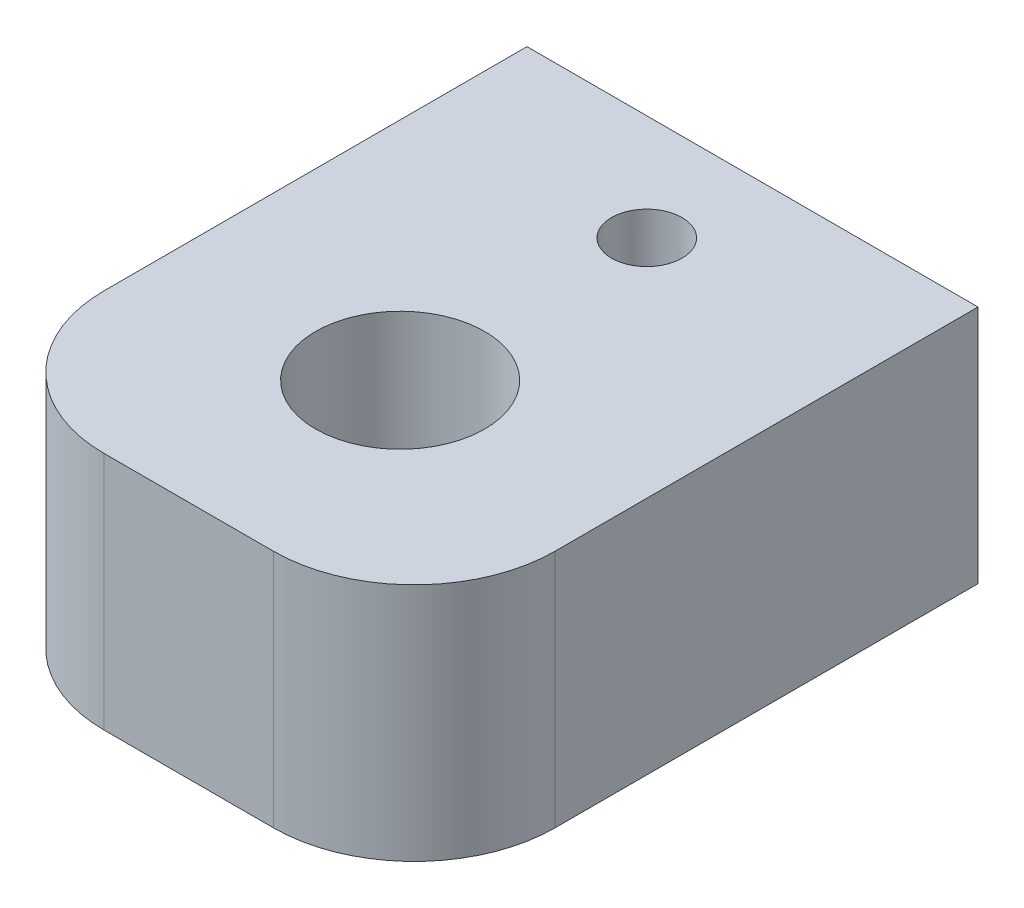
ISO-10303-21;
HEADER;
FILE_DESCRIPTION(('STEP AP214'),'2;1');
FILE_NAME('part.step','',(''),(''),'','','');
FILE_SCHEMA(('AUTOMOTIVE_DESIGN { 1 0 10303 214 1 1 1 1 }'));
ENDSEC;
DATA;
#1=APPLICATION_CONTEXT('core data for automotive mechanical design processes');
#2=APPLICATION_PROTOCOL_DEFINITION('international standard','automotive_design',2000,#1);
#3=PRODUCT_CONTEXT('',#1,'mechanical');
#4=PRODUCT('Part','Part','',(#3));
#5=PRODUCT_RELATED_PRODUCT_CATEGORY('part','',(#4));
#6=PRODUCT_DEFINITION_FORMATION('','',#4);
#7=PRODUCT_DEFINITION_CONTEXT('part definition',#1,'design');
#8=PRODUCT_DEFINITION('design','',#6,#7);
#9=PRODUCT_DEFINITION_SHAPE('','',#8);
#10=(LENGTH_UNIT() NAMED_UNIT(*) SI_UNIT(.MILLI.,.METRE.));
#11=(NAMED_UNIT(*) PLANE_ANGLE_UNIT() SI_UNIT($,.RADIAN.));
#12=(NAMED_UNIT(*) SI_UNIT($,.STERADIAN.) SOLID_ANGLE_UNIT());
#13=UNCERTAINTY_MEASURE_WITH_UNIT(LENGTH_MEASURE(1.E-05),#10,'distance_accuracy_value','');
#14=(GEOMETRIC_REPRESENTATION_CONTEXT(3) GLOBAL_UNCERTAINTY_ASSIGNED_CONTEXT((#13)) GLOBAL_UNIT_ASSIGNED_CONTEXT((#10,
#11,#12)) REPRESENTATION_CONTEXT('',''));
#15=CARTESIAN_POINT('',(0.,0.,0.));
#16=DIRECTION('',(0.,0.,1.));
#17=DIRECTION('',(1.,0.,0.));
#18=AXIS2_PLACEMENT_3D('',#15,#16,#17);
#19=CARTESIAN_POINT('',(0.,17.,-12.5));
#20=DIRECTION('',(0.,-1.,0.));
#21=DIRECTION('',(0.,0.,-1.));
#22=AXIS2_PLACEMENT_3D('',#19,#20,#21);
#23=CYLINDRICAL_SURFACE('',#22,2.5);
#24=CARTESIAN_POINT('',(0.,13.5,-15.));
#25=CARTESIAN_POINT('',(-0.131426682334305,13.4999917755047,-14.999990330944));
#26=CARTESIAN_POINT('',(-0.263015634437213,13.4947619913528,-14.989574438226));
#27=CARTESIAN_POINT('',(-0.522301454622883,13.4743541856102,-14.9483681788379));
#28=CARTESIAN_POINT('',(-0.649990448564105,13.4591572718767,-14.917539119075));
#29=CARTESIAN_POINT('',(-0.897333631316204,13.4204069092248,-14.8370153772812));
#30=CARTESIAN_POINT('',(-1.01701694536277,13.3968859590726,-14.7873940122173));
#31=CARTESIAN_POINT('',(-1.24618160399671,13.3436444332583,-14.6710734737482));
#32=CARTESIAN_POINT('',(-1.3556637520377,13.3139243464442,-14.6043756468549));
#33=CARTESIAN_POINT('',(-1.56876952630998,13.2489064505063,-14.4512068683574));
#34=CARTESIAN_POINT('',(-1.67163802294309,13.2133799765909,-14.3637837997702));
#35=CARTESIAN_POINT('',(-1.86194861703333,13.1414992577673,-14.1736963040147));
#36=CARTESIAN_POINT('',(-1.94937895911555,13.105144405669,-14.0710203711599));
#37=CARTESIAN_POINT('',(-2.11312999967247,13.0324737794562,-13.8437916255547));
#38=CARTESIAN_POINT('',(-2.18806333849064,12.9963796741257,-13.718159753965));
#39=CARTESIAN_POINT('',(-2.31542056761491,12.9321494694356,-13.4540816602046));
#40=CARTESIAN_POINT('',(-2.36786053751683,12.9040076902079,-13.3156446782374));
#41=CARTESIAN_POINT('',(-2.44533110537653,12.861446675914,-13.0383372364036));
#42=CARTESIAN_POINT('',(-2.47181464267578,12.8463067895845,-12.8999888698204));
#43=CARTESIAN_POINT('',(-2.50106748329741,12.8295472487215,-12.6200529055624));
#44=CARTESIAN_POINT('',(-2.50386022093906,12.8279142335843,-12.4784686478249));
#45=CARTESIAN_POINT('',(-2.48671821792512,12.8377732564294,-12.2142849392091));
#46=CARTESIAN_POINT('',(-2.46946139884055,12.8477190915498,-12.0914399219417));
#47=CARTESIAN_POINT('',(-2.41734962264384,12.8769057183468,-11.8506952265681));
#48=CARTESIAN_POINT('',(-2.38248905974454,12.8961494707945,-11.7327971367369));
#49=CARTESIAN_POINT('',(-2.29552445096459,12.9421869103184,-11.5019271685857));
#50=CARTESIAN_POINT('',(-2.24303766778988,12.9691460165999,-11.3891340030355));
#51=CARTESIAN_POINT('',(-2.12260421917012,13.0275851070351,-11.173414268525));
#52=CARTESIAN_POINT('',(-2.0546506095312,13.0590671195048,-11.0704921609998));
#53=CARTESIAN_POINT('',(-1.89516513728194,13.1278289475821,-10.8636968681419));
#54=CARTESIAN_POINT('',(-1.8017361459232,13.1653377559186,-10.7613578160596));
#55=CARTESIAN_POINT('',(-1.59888894685344,13.2386905825102,-10.5731614535227));
#56=CARTESIAN_POINT('',(-1.48946314143571,13.27453379897,-10.4873120199153));
#57=CARTESIAN_POINT('',(-1.25129126457962,13.3425496820741,-10.3307858474257));
#58=CARTESIAN_POINT('',(-1.12188397899853,13.3744746040502,-10.2609988188856));
#59=CARTESIAN_POINT('',(-0.851165538721986,13.4289470280311,-10.1447574273925));
#60=CARTESIAN_POINT('',(-0.709863940663163,13.4515019735889,-10.0982845374621));
#61=CARTESIAN_POINT('',(-0.431916229151781,13.4831083435358,-10.0338114907083));
#62=CARTESIAN_POINT('',(-0.295853826370907,13.4931234575324,-10.013771910633));
#63=CARTESIAN_POINT('',(-0.0219489998732891,13.5018253364779,-9.99633817216382));
#64=CARTESIAN_POINT('',(0.115892549675108,13.5005174680343,-9.9989332859015));
#65=CARTESIAN_POINT('',(0.378082429964656,13.4872798063347,-10.0255167210467));
#66=CARTESIAN_POINT('',(0.502648520123706,13.4761811421999,-10.0478313318244));
#67=CARTESIAN_POINT('',(0.746017230755972,13.4455542828753,-10.1105951797384));
#68=CARTESIAN_POINT('',(0.864819214231883,13.4260251583762,-10.1510464161359));
#69=CARTESIAN_POINT('',(1.09722152111965,13.3796062853233,-10.2499961660804));
#70=CARTESIAN_POINT('',(1.21057599249831,13.3525220441787,-10.3089776252823));
#71=CARTESIAN_POINT('',(1.42615340426439,13.2935993579975,-10.4427688391248));
#72=CARTESIAN_POINT('',(1.52837157450204,13.2617588894053,-10.5175853365199));
#73=CARTESIAN_POINT('',(1.72941922315487,13.1927055331509,-10.6894010632909));
#74=CARTESIAN_POINT('',(1.82693019428496,13.1552721200949,-10.7878571709752));
#75=CARTESIAN_POINT('',(2.0046408025722,13.0815597892159,-10.9998128780494));
#76=CARTESIAN_POINT('',(2.08482846428685,13.0452816847241,-11.1133227970699));
#77=CARTESIAN_POINT('',(2.22926978618995,12.9762798054528,-11.3591091354846));
#78=CARTESIAN_POINT('',(2.29256373922243,12.9438132398125,-11.4920281652911));
#79=CARTESIAN_POINT('',(2.39520706511459,12.8893518072675,-11.7687751688825));
#80=CARTESIAN_POINT('',(2.43458729077056,12.8673434554901,-11.912588816));
#81=CARTESIAN_POINT('',(2.48465421767005,12.8390375256935,-12.1922755573629));
#82=CARTESIAN_POINT('',(2.49773248744361,12.831434586741,-12.327585634119));
#83=CARTESIAN_POINT('',(2.50172288950899,12.8291338659258,-12.5986176673807));
#84=CARTESIAN_POINT('',(2.49264462983266,12.8344304902511,-12.7343394198736));
#85=CARTESIAN_POINT('',(2.45481530197332,12.8559465516466,-12.9887087556168));
#86=CARTESIAN_POINT('',(2.42802074302696,12.8710773633813,-13.1077511817208));
#87=CARTESIAN_POINT('',(2.35793843840544,12.909275403376,-13.3395202922));
#88=CARTESIAN_POINT('',(2.31464538728732,12.9323451843496,-13.4522449315665));
#89=CARTESIAN_POINT('',(2.20953919315538,12.9857132643341,-13.6765621527197));
#90=CARTESIAN_POINT('',(2.14667719009404,13.0163930799845,-13.787569851735));
#91=CARTESIAN_POINT('',(2.0053780838799,13.0808832707746,-13.99818624324));
#92=CARTESIAN_POINT('',(1.92693287765889,13.1146952697077,-14.0977889626287));
#93=CARTESIAN_POINT('',(1.74550556946066,13.1865581632701,-14.2953553637496));
#94=CARTESIAN_POINT('',(1.6407002246921,13.2246249151498,-14.3916493641714));
#95=CARTESIAN_POINT('',(1.41539785420684,13.2969434738354,-14.565655849428));
#96=CARTESIAN_POINT('',(1.29489242426332,13.3311932190545,-14.6433583186059));
#97=CARTESIAN_POINT('',(1.03978808878537,13.3924514945778,-14.7780969794841));
#98=CARTESIAN_POINT('',(0.90509556078229,13.4194071143749,-14.8349831677844));
#99=CARTESIAN_POINT('',(0.696328709257353,13.4517796092335,-14.9021838587924));
#100=CARTESIAN_POINT('',(0.625670413494089,13.4612231408187,-14.9215553980018));
#101=CARTESIAN_POINT('',(0.482623997839258,13.477171272751,-14.9540659483706));
#102=CARTESIAN_POINT('',(0.410236963092402,13.4836776682316,-14.9672087666763));
#103=CARTESIAN_POINT('',(0.281518684621671,13.4923820076613,-14.9847374722846));
#104=CARTESIAN_POINT('',(0.225408499555444,13.4952328846645,-14.9904549365313));
#105=CARTESIAN_POINT('',(0.112875528456288,13.4990436732966,-14.9980883294657));
#106=CARTESIAN_POINT('',(0.0564527338382177,13.500003532732,-15.0000041532255));
#107=CARTESIAN_POINT('',(0.,13.5,-15.));
#108=B_SPLINE_CURVE_WITH_KNOTS('',3,(#24,#25,#26,#27,#28,#29,#30,#31,#32,#33,#34,#35,#36,#37,
#38,#39,#40,#41,#42,#43,#44,#45,#46,#47,#48,#49,#50,#51,#52,#53,#54,#55,#56,#57,#58,#59,#60,#61,
#62,#63,#64,#65,#66,#67,#68,#69,#70,#71,#72,#73,#74,#75,#76,#77,#78,#79,#80,#81,#82,#83,#84,#85,
#86,#87,#88,#89,#90,#91,#92,#93,#94,#95,#96,#97,#98,#99,#100,#101,#102,#103,#104,#105,#106,
#107),.UNSPECIFIED.,.T.,.F.,(4,2,2,2,2,2,2,2,2,2,2,2,2,2,2,2,2,2,2,2,2,2,2,2,2,2,2,2,2,2,2,2,2,
2,2,2,2,2,2,2,2,4),(0.,0.394060643550731,0.788870374272995,1.18215538873075,1.57540940145392,
1.99245439679522,2.40981559413509,2.85954316076882,3.30894869745703,3.73145030350574,
4.15353393322551,4.52514281023301,4.89687009814196,5.27725600421219,5.65781303150555,
6.08662353334697,6.51563836496716,6.96457555536102,7.41315542280699,7.82458226178364,
8.2358141127869,8.61517266265305,8.99457304077329,9.38482140069747,9.77523626870849,
10.2039902661037,10.6330397153795,11.0828670540368,11.53211279863,11.9382326875699,
12.3441764966107,12.7114482562151,13.0788382197025,13.4709114195009,13.8631890285845,
14.303131068923,14.7433095845248,15.1866003415819,15.407934939208,15.6291340766844,
15.7983933645035,15.9676573239323),.UNSPECIFIED.);
#109=CARTESIAN_POINT('',(0.,13.5,-15.));
#110=VERTEX_POINT('',#109);
#111=EDGE_CURVE('E47',#110,#110,#108,.T.);
#112=ORIENTED_EDGE('',*,*,#111,.F.);
#113=EDGE_LOOP('',(#112));
#114=FACE_BOUND('',#113,.T.);
#115=CARTESIAN_POINT('',(0.,17.,-12.5));
#116=DIRECTION('',(0.,1.,0.));
#117=DIRECTION('',(0.,0.,1.));
#118=AXIS2_PLACEMENT_3D('',#115,#116,#117);
#119=CIRCLE('',#118,2.5);
#120=CARTESIAN_POINT('',(0.,17.,-9.99999999999999));
#121=VERTEX_POINT('',#120);
#122=EDGE_CURVE('E146',#121,#121,#119,.T.);
#123=ORIENTED_EDGE('',*,*,#122,.T.);
#124=EDGE_LOOP('',(#123));
#125=FACE_BOUND('',#124,.T.);
#126=ADVANCED_FACE('F43',(#114,#125),#23,.F.);
#127=CARTESIAN_POINT('',(-6.00000000000001,17.,10.));
#128=DIRECTION('',(0.,-1.,0.));
#129=DIRECTION('',(0.,0.,-1.));
#130=AXIS2_PLACEMENT_3D('',#127,#128,#129);
#131=PLANE('',#130);
#132=DIRECTION('',(0.,0.,1.));
#133=VECTOR('',#132,1.);
#134=CARTESIAN_POINT('',(-16.,17.,-20.));
#135=LINE('',#134,#133);
#136=CARTESIAN_POINT('',(-16.,17.,-20.));
#137=VERTEX_POINT('',#136);
#138=CARTESIAN_POINT('',(-16.,17.,10.));
#139=VERTEX_POINT('',#138);
#140=EDGE_CURVE('E158',#137,#139,#135,.T.);
#141=ORIENTED_EDGE('',*,*,#140,.T.);
#142=CARTESIAN_POINT('',(-6.00000000000001,17.,10.));
#143=DIRECTION('',(0.,1.,0.));
#144=DIRECTION('',(0.,0.,-1.));
#145=AXIS2_PLACEMENT_3D('',#142,#143,#144);
#146=CIRCLE('',#145,10.);
#147=CARTESIAN_POINT('',(-6.00000000000001,17.,20.));
#148=VERTEX_POINT('',#147);
#149=EDGE_CURVE('E105',#139,#148,#146,.T.);
#150=ORIENTED_EDGE('',*,*,#149,.T.);
#151=DIRECTION('',(1.,0.,0.));
#152=VECTOR('',#151,1.);
#153=CARTESIAN_POINT('',(-6.00000000000001,17.,20.));
#154=LINE('',#153,#152);
#155=CARTESIAN_POINT('',(6.00000000000001,17.,20.));
#156=VERTEX_POINT('',#155);
#157=EDGE_CURVE('E119',#148,#156,#154,.T.);
#158=ORIENTED_EDGE('',*,*,#157,.T.);
#159=CARTESIAN_POINT('',(6.00000000000001,17.,10.));
#160=DIRECTION('',(0.,1.,0.));
#161=DIRECTION('',(0.,0.,-1.));
#162=AXIS2_PLACEMENT_3D('',#159,#160,#161);
#163=CIRCLE('',#162,10.);
#164=CARTESIAN_POINT('',(16.,17.,10.));
#165=VERTEX_POINT('',#164);
#166=EDGE_CURVE('E112',#156,#165,#163,.T.);
#167=ORIENTED_EDGE('',*,*,#166,.T.);
#168=DIRECTION('',(0.,0.,-1.));
#169=VECTOR('',#168,1.);
#170=CARTESIAN_POINT('',(16.,17.,-20.));
#171=LINE('',#170,#169);
#172=CARTESIAN_POINT('',(16.,17.,-20.));
#173=VERTEX_POINT('',#172);
#174=EDGE_CURVE('E117',#165,#173,#171,.T.);
#175=ORIENTED_EDGE('',*,*,#174,.T.);
#176=DIRECTION('',(-1.,0.,0.));
#177=VECTOR('',#176,1.);
#178=CARTESIAN_POINT('',(-16.,17.,-20.));
#179=LINE('',#178,#177);
#180=EDGE_CURVE('E68',#173,#137,#179,.T.);
#181=ORIENTED_EDGE('',*,*,#180,.T.);
#182=EDGE_LOOP('',(#141,#150,#158,#167,#175,#181));
#183=FACE_BOUND('',#182,.T.);
#184=ORIENTED_EDGE('',*,*,#122,.F.);
#185=EDGE_LOOP('',(#184));
#186=FACE_BOUND('',#185,.T.);
#187=CARTESIAN_POINT('',(0.,17.,5.));
#188=DIRECTION('',(0.,1.,0.));
#189=DIRECTION('',(0.,0.,1.));
#190=AXIS2_PLACEMENT_3D('',#187,#188,#189);
#191=CIRCLE('',#190,6.);
#192=CARTESIAN_POINT('',(0.,17.,11.));
#193=VERTEX_POINT('',#192);
#194=EDGE_CURVE('E211',#193,#193,#191,.T.);
#195=ORIENTED_EDGE('',*,*,#194,.F.);
#196=EDGE_LOOP('',(#195));
#197=FACE_BOUND('',#196,.T.);
#198=ADVANCED_FACE('F114',(#183,#186,#197),#131,.F.);
#199=CARTESIAN_POINT('',(-6.00000000000001,0.,10.));
#200=DIRECTION('',(0.,-1.,0.));
#201=DIRECTION('',(0.,0.,-1.));
#202=AXIS2_PLACEMENT_3D('',#199,#200,#201);
#203=PLANE('',#202);
#204=CARTESIAN_POINT('',(0.,0.,-12.5));
#205=DIRECTION('',(0.,1.,0.));
#206=DIRECTION('',(0.,0.,1.));
#207=AXIS2_PLACEMENT_3D('',#204,#205,#206);
#208=CIRCLE('',#207,2.5);
#209=CARTESIAN_POINT('',(0.,0.,-9.99999999999999));
#210=VERTEX_POINT('',#209);
#211=EDGE_CURVE('E207',#210,#210,#208,.T.);
#212=ORIENTED_EDGE('',*,*,#211,.T.);
#213=EDGE_LOOP('',(#212));
#214=FACE_BOUND('',#213,.T.);
#215=DIRECTION('',(0.,0.,1.));
#216=VECTOR('',#215,1.);
#217=CARTESIAN_POINT('',(-16.,0.,-20.));
#218=LINE('',#217,#216);
#219=CARTESIAN_POINT('',(-16.,0.,-20.));
#220=VERTEX_POINT('',#219);
#221=CARTESIAN_POINT('',(-16.,0.,10.));
#222=VERTEX_POINT('',#221);
#223=EDGE_CURVE('E141',#220,#222,#218,.T.);
#224=ORIENTED_EDGE('',*,*,#223,.F.);
#225=DIRECTION('',(-1.,0.,0.));
#226=VECTOR('',#225,1.);
#227=CARTESIAN_POINT('',(-16.,0.,-20.));
#228=LINE('',#227,#226);
#229=CARTESIAN_POINT('',(16.,0.,-20.));
#230=VERTEX_POINT('',#229);
#231=EDGE_CURVE('E97',#230,#220,#228,.T.);
#232=ORIENTED_EDGE('',*,*,#231,.F.);
#233=DIRECTION('',(0.,0.,-1.));
#234=VECTOR('',#233,1.);
#235=CARTESIAN_POINT('',(16.,0.,-20.));
#236=LINE('',#235,#234);
#237=CARTESIAN_POINT('',(16.,0.,10.));
#238=VERTEX_POINT('',#237);
#239=EDGE_CURVE('E91',#238,#230,#236,.T.);
#240=ORIENTED_EDGE('',*,*,#239,.F.);
#241=CARTESIAN_POINT('',(6.00000000000001,0.,10.));
#242=DIRECTION('',(0.,1.,0.));
#243=DIRECTION('',(0.,0.,-1.));
#244=AXIS2_PLACEMENT_3D('',#241,#242,#243);
#245=CIRCLE('',#244,10.);
#246=CARTESIAN_POINT('',(6.00000000000001,0.,20.));
#247=VERTEX_POINT('',#246);
#248=EDGE_CURVE('E128',#247,#238,#245,.T.);
#249=ORIENTED_EDGE('',*,*,#248,.F.);
#250=DIRECTION('',(1.,0.,0.));
#251=VECTOR('',#250,1.);
#252=CARTESIAN_POINT('',(-6.00000000000001,0.,20.));
#253=LINE('',#252,#251);
#254=CARTESIAN_POINT('',(-6.00000000000001,0.,20.));
#255=VERTEX_POINT('',#254);
#256=EDGE_CURVE('E149',#255,#247,#253,.T.);
#257=ORIENTED_EDGE('',*,*,#256,.F.);
#258=CARTESIAN_POINT('',(-6.00000000000001,0.,10.));
#259=DIRECTION('',(0.,1.,0.));
#260=DIRECTION('',(0.,0.,-1.));
#261=AXIS2_PLACEMENT_3D('',#258,#259,#260);
#262=CIRCLE('',#261,10.);
#263=EDGE_CURVE('E145',#222,#255,#262,.T.);
#264=ORIENTED_EDGE('',*,*,#263,.F.);
#265=EDGE_LOOP('',(#224,#232,#240,#249,#257,#264));
#266=FACE_BOUND('',#265,.T.);
#267=CARTESIAN_POINT('',(0.,0.,5.));
#268=DIRECTION('',(0.,1.,0.));
#269=DIRECTION('',(0.,0.,1.));
#270=AXIS2_PLACEMENT_3D('',#267,#268,#269);
#271=CIRCLE('',#270,6.);
#272=CARTESIAN_POINT('',(0.,0.,11.));
#273=VERTEX_POINT('',#272);
#274=EDGE_CURVE('E214',#273,#273,#271,.T.);
#275=ORIENTED_EDGE('',*,*,#274,.T.);
#276=EDGE_LOOP('',(#275));
#277=FACE_BOUND('',#276,.T.);
#278=ADVANCED_FACE('F200',(#214,#266,#277),#203,.T.);
#279=CARTESIAN_POINT('',(-16.,17.,-20.));
#280=DIRECTION('',(1.,0.,0.));
#281=DIRECTION('',(0.,0.,-1.));
#282=AXIS2_PLACEMENT_3D('',#279,#280,#281);
#283=PLANE('',#282);
#284=ORIENTED_EDGE('',*,*,#223,.T.);
#285=DIRECTION('',(0.,-1.,0.));
#286=VECTOR('',#285,1.);
#287=CARTESIAN_POINT('',(-16.,17.,10.));
#288=LINE('',#287,#286);
#289=EDGE_CURVE('E11',#139,#222,#288,.T.);
#290=ORIENTED_EDGE('',*,*,#289,.F.);
#291=ORIENTED_EDGE('',*,*,#140,.F.);
#292=DIRECTION('',(0.,-1.,0.));
#293=VECTOR('',#292,1.);
#294=CARTESIAN_POINT('',(-16.,17.,-20.));
#295=LINE('',#294,#293);
#296=EDGE_CURVE('E137',#137,#220,#295,.T.);
#297=ORIENTED_EDGE('',*,*,#296,.T.);
#298=EDGE_LOOP('',(#284,#290,#291,#297));
#299=FACE_BOUND('',#298,.T.);
#300=ADVANCED_FACE('F45',(#299),#283,.F.);
#301=CARTESIAN_POINT('',(-6.00000000000001,17.,10.));
#302=DIRECTION('',(0.,-1.,0.));
#303=DIRECTION('',(0.,0.,-1.));
#304=AXIS2_PLACEMENT_3D('',#301,#302,#303);
#305=CYLINDRICAL_SURFACE('',#304,10.);
#306=ORIENTED_EDGE('',*,*,#263,.T.);
#307=DIRECTION('',(0.,-1.,0.));
#308=VECTOR('',#307,1.);
#309=CARTESIAN_POINT('',(-6.00000000000001,17.,20.));
#310=LINE('',#309,#308);
#311=EDGE_CURVE('E59',#148,#255,#310,.T.);
#312=ORIENTED_EDGE('',*,*,#311,.F.);
#313=ORIENTED_EDGE('',*,*,#149,.F.);
#314=ORIENTED_EDGE('',*,*,#289,.T.);
#315=EDGE_LOOP('',(#306,#312,#313,#314));
#316=FACE_BOUND('',#315,.T.);
#317=ADVANCED_FACE('F223',(#316),#305,.T.);
#318=CARTESIAN_POINT('',(-6.00000000000001,17.,20.));
#319=DIRECTION('',(0.,0.,-1.));
#320=DIRECTION('',(-1.,0.,0.));
#321=AXIS2_PLACEMENT_3D('',#318,#319,#320);
#322=PLANE('',#321);
#323=ORIENTED_EDGE('',*,*,#256,.T.);
#324=DIRECTION('',(0.,-1.,0.));
#325=VECTOR('',#324,1.);
#326=CARTESIAN_POINT('',(6.00000000000001,17.,20.));
#327=LINE('',#326,#325);
#328=EDGE_CURVE('E130',#156,#247,#327,.T.);
#329=ORIENTED_EDGE('',*,*,#328,.F.);
#330=ORIENTED_EDGE('',*,*,#157,.F.);
#331=ORIENTED_EDGE('',*,*,#311,.T.);
#332=EDGE_LOOP('',(#323,#329,#330,#331));
#333=FACE_BOUND('',#332,.T.);
#334=ADVANCED_FACE('F226',(#333),#322,.F.);
#335=CARTESIAN_POINT('',(6.00000000000001,17.,10.));
#336=DIRECTION('',(0.,-1.,0.));
#337=DIRECTION('',(0.,0.,-1.));
#338=AXIS2_PLACEMENT_3D('',#335,#336,#337);
#339=CYLINDRICAL_SURFACE('',#338,10.);
#340=ORIENTED_EDGE('',*,*,#248,.T.);
#341=DIRECTION('',(0.,-1.,0.));
#342=VECTOR('',#341,1.);
#343=CARTESIAN_POINT('',(16.,17.,10.));
#344=LINE('',#343,#342);
#345=EDGE_CURVE('E125',#165,#238,#344,.T.);
#346=ORIENTED_EDGE('',*,*,#345,.F.);
#347=ORIENTED_EDGE('',*,*,#166,.F.);
#348=ORIENTED_EDGE('',*,*,#328,.T.);
#349=EDGE_LOOP('',(#340,#346,#347,#348));
#350=FACE_BOUND('',#349,.T.);
#351=ADVANCED_FACE('F126',(#350),#339,.T.);
#352=CARTESIAN_POINT('',(16.,17.,-20.));
#353=DIRECTION('',(-1.,0.,0.));
#354=DIRECTION('',(0.,0.,1.));
#355=AXIS2_PLACEMENT_3D('',#352,#353,#354);
#356=PLANE('',#355);
#357=ORIENTED_EDGE('',*,*,#239,.T.);
#358=DIRECTION('',(0.,-1.,0.));
#359=VECTOR('',#358,1.);
#360=CARTESIAN_POINT('',(16.,17.,-20.));
#361=LINE('',#360,#359);
#362=EDGE_CURVE('E131',#173,#230,#361,.T.);
#363=ORIENTED_EDGE('',*,*,#362,.F.);
#364=ORIENTED_EDGE('',*,*,#174,.F.);
#365=ORIENTED_EDGE('',*,*,#345,.T.);
#366=EDGE_LOOP('',(#357,#363,#364,#365));
#367=FACE_BOUND('',#366,.T.);
#368=ADVANCED_FACE('F133',(#367),#356,.F.);
#369=CARTESIAN_POINT('',(-16.,17.,-20.));
#370=DIRECTION('',(0.,0.,1.));
#371=DIRECTION('',(1.,0.,0.));
#372=AXIS2_PLACEMENT_3D('',#369,#370,#371);
#373=PLANE('',#372);
#374=CARTESIAN_POINT('',(0.,8.5,-20.));
#375=DIRECTION('',(0.,0.,-1.));
#376=DIRECTION('',(-1.,0.,0.));
#377=AXIS2_PLACEMENT_3D('',#374,#375,#376);
#378=CIRCLE('',#377,5.);
#379=CARTESIAN_POINT('',(-5.00000000000001,8.5,-20.));
#380=VERTEX_POINT('',#379);
#381=EDGE_CURVE('E349',#380,#380,#378,.T.);
#382=ORIENTED_EDGE('',*,*,#381,.F.);
#383=EDGE_LOOP('',(#382));
#384=FACE_BOUND('',#383,.T.);
#385=ORIENTED_EDGE('',*,*,#231,.T.);
#386=ORIENTED_EDGE('',*,*,#296,.F.);
#387=ORIENTED_EDGE('',*,*,#180,.F.);
#388=ORIENTED_EDGE('',*,*,#362,.T.);
#389=EDGE_LOOP('',(#385,#386,#387,#388));
#390=FACE_BOUND('',#389,.T.);
#391=ADVANCED_FACE('F191',(#384,#390),#373,.F.);
#392=CARTESIAN_POINT('',(0.,3.5,-15.));
#393=CARTESIAN_POINT('',(0.131426682334305,3.50000822449528,-14.999990330944));
#394=CARTESIAN_POINT('',(0.263015634437213,3.50523800864723,-14.989574438226));
#395=CARTESIAN_POINT('',(0.522301454622883,3.5256458143898,-14.9483681788379));
#396=CARTESIAN_POINT('',(0.649990448564105,3.5408427281233,-14.917539119075));
#397=CARTESIAN_POINT('',(0.897333631316204,3.57959309077523,-14.8370153772812));
#398=CARTESIAN_POINT('',(1.01701694536277,3.60311404092741,-14.7873940122173));
#399=CARTESIAN_POINT('',(1.24618160399671,3.65635556674173,-14.6710734737482));
#400=CARTESIAN_POINT('',(1.3556637520377,3.68607565355579,-14.6043756468549));
#401=CARTESIAN_POINT('',(1.56876952630998,3.75109354949368,-14.4512068683574));
#402=CARTESIAN_POINT('',(1.67163802294309,3.78662002340909,-14.3637837997702));
#403=CARTESIAN_POINT('',(1.86194861703333,3.85850074223269,-14.1736963040147));
#404=CARTESIAN_POINT('',(1.94937895911555,3.89485559433103,-14.0710203711599));
#405=CARTESIAN_POINT('',(2.11312999967247,3.96752622054379,-13.8437916255547));
#406=CARTESIAN_POINT('',(2.18806333849064,4.00362032587433,-13.718159753965));
#407=CARTESIAN_POINT('',(2.31542056761491,4.06785053056445,-13.4540816602046));
#408=CARTESIAN_POINT('',(2.36786053751683,4.09599230979208,-13.3156446782374));
#409=CARTESIAN_POINT('',(2.44533110537653,4.13855332408598,-13.0383372364036));
#410=CARTESIAN_POINT('',(2.47181464267578,4.15369321041548,-12.8999888698204));
#411=CARTESIAN_POINT('',(2.50106748329741,4.1704527512785,-12.6200529055624));
#412=CARTESIAN_POINT('',(2.50386022093906,4.17208576641571,-12.4784686478249));
#413=CARTESIAN_POINT('',(2.48671821792512,4.16222674357064,-12.2142849392091));
#414=CARTESIAN_POINT('',(2.46946139884055,4.15228090845016,-12.0914399219417));
#415=CARTESIAN_POINT('',(2.41734962264384,4.12309428165325,-11.8506952265681));
#416=CARTESIAN_POINT('',(2.38248905974454,4.10385052920546,-11.7327971367369));
#417=CARTESIAN_POINT('',(2.29552445096459,4.05781308968161,-11.5019271685857));
#418=CARTESIAN_POINT('',(2.24303766778988,4.03085398340007,-11.3891340030355));
#419=CARTESIAN_POINT('',(2.12260421917012,3.97241489296487,-11.173414268525));
#420=CARTESIAN_POINT('',(2.0546506095312,3.94093288049523,-11.0704921609998));
#421=CARTESIAN_POINT('',(1.89516513728194,3.87217105241787,-10.8636968681419));
#422=CARTESIAN_POINT('',(1.8017361459232,3.83466224408135,-10.7613578160596));
#423=CARTESIAN_POINT('',(1.59888894685344,3.76130941748981,-10.5731614535227));
#424=CARTESIAN_POINT('',(1.48946314143571,3.72546620102997,-10.4873120199153));
#425=CARTESIAN_POINT('',(1.25129126457962,3.65745031792591,-10.3307858474257));
#426=CARTESIAN_POINT('',(1.12188397899853,3.62552539594985,-10.2609988188856));
#427=CARTESIAN_POINT('',(0.851165538721985,3.57105297196892,-10.1447574273925));
#428=CARTESIAN_POINT('',(0.709863940663163,3.54849802641107,-10.0982845374621));
#429=CARTESIAN_POINT('',(0.431916229151781,3.51689165646421,-10.0338114907083));
#430=CARTESIAN_POINT('',(0.295853826370906,3.5068765424676,-10.013771910633));
#431=CARTESIAN_POINT('',(0.0219489998732881,3.49817466352206,-9.99633817216382));
#432=CARTESIAN_POINT('',(-0.11589254967511,3.49948253196574,-9.9989332859015));
#433=CARTESIAN_POINT('',(-0.378082429964657,3.51272019366532,-10.0255167210467));
#434=CARTESIAN_POINT('',(-0.502648520123706,3.52381885780008,-10.0478313318244));
#435=CARTESIAN_POINT('',(-0.746017230755972,3.55444571712471,-10.1105951797384));
#436=CARTESIAN_POINT('',(-0.864819214231884,3.57397484162375,-10.1510464161359));
#437=CARTESIAN_POINT('',(-1.09722152111965,3.62039371467671,-10.2499961660804));
#438=CARTESIAN_POINT('',(-1.21057599249831,3.64747795582127,-10.3089776252823));
#439=CARTESIAN_POINT('',(-1.42615340426439,3.7064006420025,-10.4427688391248));
#440=CARTESIAN_POINT('',(-1.52837157450204,3.73824111059466,-10.5175853365199));
#441=CARTESIAN_POINT('',(-1.72941922315487,3.80729446684913,-10.6894010632909));
#442=CARTESIAN_POINT('',(-1.82693019428496,3.84472787990512,-10.7878571709752));
#443=CARTESIAN_POINT('',(-2.0046408025722,3.91844021078413,-10.9998128780494));
#444=CARTESIAN_POINT('',(-2.08482846428685,3.95471831527593,-11.1133227970699));
#445=CARTESIAN_POINT('',(-2.22926978618995,4.0237201945472,-11.3591091354846));
#446=CARTESIAN_POINT('',(-2.29256373922243,4.05618676018746,-11.4920281652911));
#447=CARTESIAN_POINT('',(-2.39520706511459,4.11064819273254,-11.7687751688825));
#448=CARTESIAN_POINT('',(-2.43458729077056,4.13265654450986,-11.912588816));
#449=CARTESIAN_POINT('',(-2.48465421767005,4.16096247430649,-12.1922755573629));
#450=CARTESIAN_POINT('',(-2.49773248744361,4.16856541325903,-12.327585634119));
#451=CARTESIAN_POINT('',(-2.50172288950899,4.17086613407421,-12.5986176673807));
#452=CARTESIAN_POINT('',(-2.49264462983266,4.1655695097489,-12.7343394198736));
#453=CARTESIAN_POINT('',(-2.45481530197332,4.14405344835337,-12.9887087556168));
#454=CARTESIAN_POINT('',(-2.42802074302696,4.12892263661867,-13.1077511817208));
#455=CARTESIAN_POINT('',(-2.35793843840544,4.09072459662397,-13.3395202922));
#456=CARTESIAN_POINT('',(-2.31464538728732,4.06765481565035,-13.4522449315665));
#457=CARTESIAN_POINT('',(-2.20953919315538,4.01428673566587,-13.6765621527197));
#458=CARTESIAN_POINT('',(-2.14667719009404,3.9836069200155,-13.787569851735));
#459=CARTESIAN_POINT('',(-2.0053780838799,3.91911672922545,-13.99818624324));
#460=CARTESIAN_POINT('',(-1.92693287765888,3.88530473029233,-14.0977889626287));
#461=CARTESIAN_POINT('',(-1.74550556946066,3.81344183672989,-14.2953553637496));
#462=CARTESIAN_POINT('',(-1.6407002246921,3.77537508485019,-14.3916493641714));
#463=CARTESIAN_POINT('',(-1.41539785420684,3.70305652616455,-14.565655849428));
#464=CARTESIAN_POINT('',(-1.29489242426332,3.66880678094554,-14.6433583186059));
#465=CARTESIAN_POINT('',(-1.03978808878536,3.60754850542218,-14.7780969794841));
#466=CARTESIAN_POINT('',(-0.905095560782288,3.58059288562512,-14.8349831677844));
#467=CARTESIAN_POINT('',(-0.696328709257352,3.54822039076649,-14.9021838587924));
#468=CARTESIAN_POINT('',(-0.625670413494089,3.53877685918126,-14.9215553980018));
#469=CARTESIAN_POINT('',(-0.482623997839259,3.52282872724899,-14.9540659483706));
#470=CARTESIAN_POINT('',(-0.410236963092402,3.51632233176841,-14.9672087666763));
#471=CARTESIAN_POINT('',(-0.281518684621671,3.5076179923387,-14.9847374722846));
#472=CARTESIAN_POINT('',(-0.225408499555445,3.50476711533546,-14.9904549365313));
#473=CARTESIAN_POINT('',(-0.112875528456289,3.50095632670341,-14.9980883294657));
#474=CARTESIAN_POINT('',(-0.056452733838218,3.49999646726802,-15.0000041532255));
#475=CARTESIAN_POINT('',(0.,3.5,-15.));
#476=B_SPLINE_CURVE_WITH_KNOTS('',3,(#392,#393,#394,#395,#396,#397,#398,#399,#400,#401,#402,
#403,#404,#405,#406,#407,#408,#409,#410,#411,#412,#413,#414,#415,#416,#417,#418,#419,#420,#421,
#422,#423,#424,#425,#426,#427,#428,#429,#430,#431,#432,#433,#434,#435,#436,#437,#438,#439,#440,
#441,#442,#443,#444,#445,#446,#447,#448,#449,#450,#451,#452,#453,#454,#455,#456,#457,#458,#459,
#460,#461,#462,#463,#464,#465,#466,#467,#468,#469,#470,#471,#472,#473,#474,#475),.UNSPECIFIED.,
.T.,.F.,(4,2,2,2,2,2,2,2,2,2,2,2,2,2,2,2,2,2,2,2,2,2,2,2,2,2,2,2,2,2,2,2,2,2,2,2,2,2,2,2,2,4),
(0.,0.394060643550731,0.788870374272995,1.18215538873075,1.57540940145392,1.99245439679522,
2.40981559413509,2.85954316076882,3.30894869745703,3.73145030350574,4.15353393322551,
4.52514281023302,4.89687009814197,5.27725600421219,5.65781303150555,6.08662353334697,
6.51563836496716,6.96457555536102,7.413155422807,7.82458226178365,8.23581411278691,
8.61517266265306,8.9945730407733,9.38482140069748,9.77523626870849,10.2039902661037,
10.6330397153795,11.0828670540368,11.53211279863,11.9382326875699,12.3441764966107,
12.7114482562151,13.0788382197025,13.4709114195009,13.8631890285845,14.303131068923,
14.7433095845248,15.1866003415819,15.407934939208,15.6291340766844,15.7983933645035,
15.9676573239323),.UNSPECIFIED.);
#477=CARTESIAN_POINT('',(0.,3.5,-15.));
#478=VERTEX_POINT('',#477);
#479=EDGE_CURVE('E167',#478,#478,#476,.T.);
#480=ORIENTED_EDGE('',*,*,#479,.F.);
#481=EDGE_LOOP('',(#480));
#482=FACE_BOUND('',#481,.T.);
#483=ORIENTED_EDGE('',*,*,#211,.F.);
#484=EDGE_LOOP('',(#483));
#485=FACE_BOUND('',#484,.T.);
#486=ADVANCED_FACE('F174',(#482,#485),#23,.F.);
#487=CARTESIAN_POINT('',(0.,17.,5.));
#488=DIRECTION('',(0.,-1.,0.));
#489=DIRECTION('',(0.,0.,-1.));
#490=AXIS2_PLACEMENT_3D('',#487,#488,#489);
#491=CYLINDRICAL_SURFACE('',#490,6.);
#492=ORIENTED_EDGE('',*,*,#194,.T.);
#493=EDGE_LOOP('',(#492));
#494=FACE_BOUND('',#493,.T.);
#495=ORIENTED_EDGE('',*,*,#274,.F.);
#496=EDGE_LOOP('',(#495));
#497=FACE_BOUND('',#496,.T.);
#498=ADVANCED_FACE('F183',(#494,#497),#491,.F.);
#499=CARTESIAN_POINT('',(0.,8.5,-5.));
#500=DIRECTION('',(0.,0.,-1.));
#501=DIRECTION('',(-1.,0.,0.));
#502=AXIS2_PLACEMENT_3D('',#499,#500,#501);
#503=CYLINDRICAL_SURFACE('',#502,5.);
#504=ORIENTED_EDGE('',*,*,#111,.T.);
#505=EDGE_LOOP('',(#504));
#506=FACE_BOUND('',#505,.T.);
#507=ORIENTED_EDGE('',*,*,#479,.T.);
#508=EDGE_LOOP('',(#507));
#509=FACE_BOUND('',#508,.T.);
#510=CARTESIAN_POINT('',(0.,8.5,-5.));
#511=DIRECTION('',(0.,0.,-1.));
#512=DIRECTION('',(-1.,0.,0.));
#513=AXIS2_PLACEMENT_3D('',#510,#511,#512);
#514=CIRCLE('',#513,5.);
#515=CARTESIAN_POINT('',(-5.,8.5,-5.));
#516=VERTEX_POINT('',#515);
#517=EDGE_CURVE('E173',#516,#516,#514,.T.);
#518=ORIENTED_EDGE('',*,*,#517,.F.);
#519=EDGE_LOOP('',(#518));
#520=FACE_BOUND('',#519,.T.);
#521=ORIENTED_EDGE('',*,*,#381,.T.);
#522=EDGE_LOOP('',(#521));
#523=FACE_BOUND('',#522,.T.);
#524=ADVANCED_FACE('F178',(#506,#509,#520,#523),#503,.F.);
#525=CARTESIAN_POINT('',(0.,8.5,-5.));
#526=DIRECTION('',(0.,0.,-1.));
#527=DIRECTION('',(-1.,0.,0.));
#528=AXIS2_PLACEMENT_3D('',#525,#526,#527);
#529=PLANE('',#528);
#530=ORIENTED_EDGE('',*,*,#517,.T.);
#531=EDGE_LOOP('',(#530));
#532=FACE_BOUND('',#531,.T.);
#533=ADVANCED_FACE('F182',(#532),#529,.T.);
#534=CLOSED_SHELL('',(#126,#198,#278,#300,#317,#334,#351,#368,#391,#486,#498,#524,#533));
#535=MANIFOLD_SOLID_BREP('B2',#534);
#536=ADVANCED_BREP_SHAPE_REPRESENTATION('',(#18,#535),#14);
#537=SHAPE_DEFINITION_REPRESENTATION(#9,#536);
ENDSEC;
END-ISO-10303-21;
